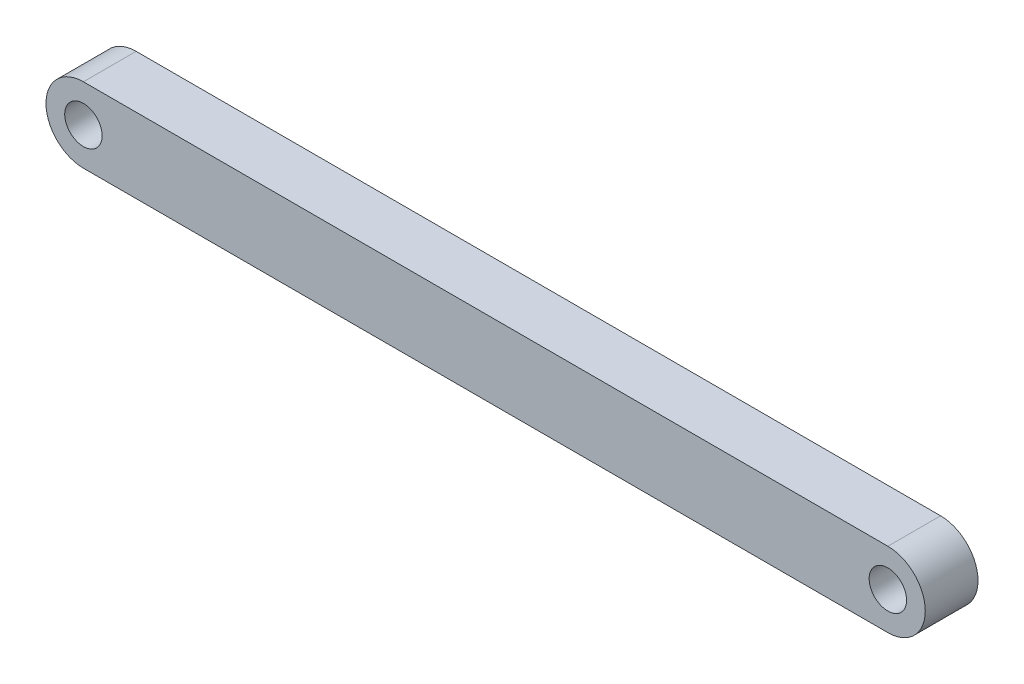
ISO-10303-21;
HEADER;
FILE_DESCRIPTION(('STEP AP214'),'2;1');
FILE_NAME('part.step','',(''),(''),'','','');
FILE_SCHEMA(('AUTOMOTIVE_DESIGN { 1 0 10303 214 1 1 1 1 }'));
ENDSEC;
DATA;
#1=APPLICATION_CONTEXT('core data for automotive mechanical design processes');
#2=APPLICATION_PROTOCOL_DEFINITION('international standard','automotive_design',2000,#1);
#3=PRODUCT_CONTEXT('',#1,'mechanical');
#4=PRODUCT('Part','Part','',(#3));
#5=PRODUCT_RELATED_PRODUCT_CATEGORY('part','',(#4));
#6=PRODUCT_DEFINITION_FORMATION('','',#4);
#7=PRODUCT_DEFINITION_CONTEXT('part definition',#1,'design');
#8=PRODUCT_DEFINITION('design','',#6,#7);
#9=PRODUCT_DEFINITION_SHAPE('','',#8);
#10=(LENGTH_UNIT() NAMED_UNIT(*) SI_UNIT(.MILLI.,.METRE.));
#11=(NAMED_UNIT(*) PLANE_ANGLE_UNIT() SI_UNIT($,.RADIAN.));
#12=(NAMED_UNIT(*) SI_UNIT($,.STERADIAN.) SOLID_ANGLE_UNIT());
#13=UNCERTAINTY_MEASURE_WITH_UNIT(LENGTH_MEASURE(1.E-05),#10,'distance_accuracy_value','');
#14=(GEOMETRIC_REPRESENTATION_CONTEXT(3) GLOBAL_UNCERTAINTY_ASSIGNED_CONTEXT((#13)) GLOBAL_UNIT_ASSIGNED_CONTEXT((#10,
#11,#12)) REPRESENTATION_CONTEXT('',''));
#15=CARTESIAN_POINT('',(0.,0.,0.));
#16=DIRECTION('',(0.,0.,1.));
#17=DIRECTION('',(1.,0.,0.));
#18=AXIS2_PLACEMENT_3D('',#15,#16,#17);
#19=CARTESIAN_POINT('',(-38.15,-2.66400026153731E-13,2.5));
#20=DIRECTION('',(0.,0.,1.));
#21=DIRECTION('',(1.,0.,0.));
#22=AXIS2_PLACEMENT_3D('',#19,#20,#21);
#23=PLANE('',#22);
#24=CARTESIAN_POINT('',(0.,0.,2.5));
#25=DIRECTION('',(0.,0.,1.));
#26=DIRECTION('',(1.,0.,0.));
#27=AXIS2_PLACEMENT_3D('',#24,#25,#26);
#28=CIRCLE('',#27,0.8875);
#29=CARTESIAN_POINT('',(0.8875,0.,2.5));
#30=VERTEX_POINT('',#29);
#31=EDGE_CURVE('E106',#30,#30,#28,.T.);
#32=ORIENTED_EDGE('',*,*,#31,.F.);
#33=EDGE_LOOP('',(#32));
#34=FACE_BOUND('',#33,.T.);
#35=CARTESIAN_POINT('',(-38.15,-2.66400026153731E-13,2.5));
#36=DIRECTION('',(0.,0.,1.));
#37=DIRECTION('',(1.,0.,0.));
#38=AXIS2_PLACEMENT_3D('',#35,#36,#37);
#39=CIRCLE('',#38,1.77499999999973);
#40=CARTESIAN_POINT('',(-38.15,1.77499999999973,2.5));
#41=VERTEX_POINT('',#40);
#42=CARTESIAN_POINT('',(-38.15,-1.77499999999973,2.5));
#43=VERTEX_POINT('',#42);
#44=EDGE_CURVE('E91',#41,#43,#39,.T.);
#45=ORIENTED_EDGE('',*,*,#44,.T.);
#46=DIRECTION('',(1.,0.,0.));
#47=VECTOR('',#46,1.);
#48=CARTESIAN_POINT('',(-38.15,-1.77499999999973,2.5));
#49=LINE('',#48,#47);
#50=CARTESIAN_POINT('',(0.,-1.77499999999968,2.5));
#51=VERTEX_POINT('',#50);
#52=EDGE_CURVE('E86',#43,#51,#49,.T.);
#53=ORIENTED_EDGE('',*,*,#52,.T.);
#54=CARTESIAN_POINT('',(0.,0.,2.5));
#55=DIRECTION('',(0.,0.,1.));
#56=DIRECTION('',(1.,0.,0.));
#57=AXIS2_PLACEMENT_3D('',#54,#55,#56);
#58=CIRCLE('',#57,1.77499999999968);
#59=CARTESIAN_POINT('',(0.,1.77499999999993,2.5));
#60=VERTEX_POINT('',#59);
#61=EDGE_CURVE('E89',#51,#60,#58,.T.);
#62=ORIENTED_EDGE('',*,*,#61,.T.);
#63=DIRECTION('',(-1.,0.,0.));
#64=VECTOR('',#63,1.);
#65=CARTESIAN_POINT('',(-38.15,1.77499999999973,2.5));
#66=LINE('',#65,#64);
#67=EDGE_CURVE('E56',#60,#41,#66,.T.);
#68=ORIENTED_EDGE('',*,*,#67,.T.);
#69=EDGE_LOOP('',(#45,#53,#62,#68));
#70=FACE_BOUND('',#69,.T.);
#71=CARTESIAN_POINT('',(-38.15,-2.66400026153731E-13,2.5));
#72=DIRECTION('',(0.,0.,1.));
#73=DIRECTION('',(1.,0.,0.));
#74=AXIS2_PLACEMENT_3D('',#71,#72,#73);
#75=CIRCLE('',#74,0.887499999999998);
#76=CARTESIAN_POINT('',(-37.2625,-2.66400026153731E-13,2.5));
#77=VERTEX_POINT('',#76);
#78=EDGE_CURVE('E121',#77,#77,#75,.T.);
#79=ORIENTED_EDGE('',*,*,#78,.F.);
#80=EDGE_LOOP('',(#79));
#81=FACE_BOUND('',#80,.T.);
#82=ADVANCED_FACE('F39',(#34,#70,#81),#23,.T.);
#83=CARTESIAN_POINT('',(-38.15,-2.66400026153731E-13,0.));
#84=DIRECTION('',(0.,0.,1.));
#85=DIRECTION('',(1.,0.,0.));
#86=AXIS2_PLACEMENT_3D('',#83,#84,#85);
#87=PLANE('',#86);
#88=CARTESIAN_POINT('',(-38.15,-2.66400026153731E-13,0.));
#89=DIRECTION('',(0.,0.,1.));
#90=DIRECTION('',(1.,0.,0.));
#91=AXIS2_PLACEMENT_3D('',#88,#89,#90);
#92=CIRCLE('',#91,1.77499999999973);
#93=CARTESIAN_POINT('',(-38.15,1.77499999999973,0.));
#94=VERTEX_POINT('',#93);
#95=CARTESIAN_POINT('',(-38.15,-1.77499999999973,0.));
#96=VERTEX_POINT('',#95);
#97=EDGE_CURVE('E103',#94,#96,#92,.T.);
#98=ORIENTED_EDGE('',*,*,#97,.F.);
#99=DIRECTION('',(-1.,0.,0.));
#100=VECTOR('',#99,1.);
#101=CARTESIAN_POINT('',(-38.15,1.77499999999973,0.));
#102=LINE('',#101,#100);
#103=CARTESIAN_POINT('',(0.,1.77499999999993,0.));
#104=VERTEX_POINT('',#103);
#105=EDGE_CURVE('E79',#104,#94,#102,.T.);
#106=ORIENTED_EDGE('',*,*,#105,.F.);
#107=CARTESIAN_POINT('',(0.,0.,0.));
#108=DIRECTION('',(0.,0.,1.));
#109=DIRECTION('',(1.,0.,0.));
#110=AXIS2_PLACEMENT_3D('',#107,#108,#109);
#111=CIRCLE('',#110,1.77499999999968);
#112=CARTESIAN_POINT('',(0.,-1.77499999999968,0.));
#113=VERTEX_POINT('',#112);
#114=EDGE_CURVE('E73',#113,#104,#111,.T.);
#115=ORIENTED_EDGE('',*,*,#114,.F.);
#116=DIRECTION('',(1.,0.,0.));
#117=VECTOR('',#116,1.);
#118=CARTESIAN_POINT('',(-38.15,-1.77499999999973,0.));
#119=LINE('',#118,#117);
#120=EDGE_CURVE('E95',#96,#113,#119,.T.);
#121=ORIENTED_EDGE('',*,*,#120,.F.);
#122=EDGE_LOOP('',(#98,#106,#115,#121));
#123=FACE_BOUND('',#122,.T.);
#124=CARTESIAN_POINT('',(0.,0.,0.));
#125=DIRECTION('',(0.,0.,1.));
#126=DIRECTION('',(1.,0.,0.));
#127=AXIS2_PLACEMENT_3D('',#124,#125,#126);
#128=CIRCLE('',#127,0.8875);
#129=CARTESIAN_POINT('',(0.8875,0.,0.));
#130=VERTEX_POINT('',#129);
#131=EDGE_CURVE('E118',#130,#130,#128,.T.);
#132=ORIENTED_EDGE('',*,*,#131,.T.);
#133=EDGE_LOOP('',(#132));
#134=FACE_BOUND('',#133,.T.);
#135=CARTESIAN_POINT('',(-38.15,-2.66400026153731E-13,0.));
#136=DIRECTION('',(0.,0.,1.));
#137=DIRECTION('',(1.,0.,0.));
#138=AXIS2_PLACEMENT_3D('',#135,#136,#137);
#139=CIRCLE('',#138,0.887499999999998);
#140=CARTESIAN_POINT('',(-37.2625,-2.66400026153731E-13,0.));
#141=VERTEX_POINT('',#140);
#142=EDGE_CURVE('E124',#141,#141,#139,.T.);
#143=ORIENTED_EDGE('',*,*,#142,.T.);
#144=EDGE_LOOP('',(#143));
#145=FACE_BOUND('',#144,.T.);
#146=ADVANCED_FACE('F114',(#123,#134,#145),#87,.F.);
#147=CARTESIAN_POINT('',(-38.15,-2.66400026153731E-13,2.5));
#148=DIRECTION('',(0.,0.,-1.));
#149=DIRECTION('',(-1.,0.,0.));
#150=AXIS2_PLACEMENT_3D('',#147,#148,#149);
#151=CYLINDRICAL_SURFACE('',#150,1.77499999999973);
#152=ORIENTED_EDGE('',*,*,#97,.T.);
#153=DIRECTION('',(0.,0.,-1.));
#154=VECTOR('',#153,1.);
#155=CARTESIAN_POINT('',(-38.15,-1.77499999999973,2.5));
#156=LINE('',#155,#154);
#157=EDGE_CURVE('E11',#43,#96,#156,.T.);
#158=ORIENTED_EDGE('',*,*,#157,.F.);
#159=ORIENTED_EDGE('',*,*,#44,.F.);
#160=DIRECTION('',(0.,0.,-1.));
#161=VECTOR('',#160,1.);
#162=CARTESIAN_POINT('',(-38.15,1.77499999999973,2.5));
#163=LINE('',#162,#161);
#164=EDGE_CURVE('E99',#41,#94,#163,.T.);
#165=ORIENTED_EDGE('',*,*,#164,.T.);
#166=EDGE_LOOP('',(#152,#158,#159,#165));
#167=FACE_BOUND('',#166,.T.);
#168=ADVANCED_FACE('F41',(#167),#151,.T.);
#169=CARTESIAN_POINT('',(-38.15,-1.77499999999973,2.5));
#170=DIRECTION('',(0.,1.,0.));
#171=DIRECTION('',(-1.,0.,0.));
#172=AXIS2_PLACEMENT_3D('',#169,#170,#171);
#173=PLANE('',#172);
#174=ORIENTED_EDGE('',*,*,#120,.T.);
#175=DIRECTION('',(0.,0.,-1.));
#176=VECTOR('',#175,1.);
#177=CARTESIAN_POINT('',(0.,-1.77499999999968,2.5));
#178=LINE('',#177,#176);
#179=EDGE_CURVE('E48',#51,#113,#178,.T.);
#180=ORIENTED_EDGE('',*,*,#179,.F.);
#181=ORIENTED_EDGE('',*,*,#52,.F.);
#182=ORIENTED_EDGE('',*,*,#157,.T.);
#183=EDGE_LOOP('',(#174,#180,#181,#182));
#184=FACE_BOUND('',#183,.T.);
#185=ADVANCED_FACE('F94',(#184),#173,.F.);
#186=CARTESIAN_POINT('',(0.,0.,2.5));
#187=DIRECTION('',(0.,0.,-1.));
#188=DIRECTION('',(-1.,0.,0.));
#189=AXIS2_PLACEMENT_3D('',#186,#187,#188);
#190=CYLINDRICAL_SURFACE('',#189,1.77499999999968);
#191=ORIENTED_EDGE('',*,*,#114,.T.);
#192=DIRECTION('',(0.,0.,-1.));
#193=VECTOR('',#192,1.);
#194=CARTESIAN_POINT('',(0.,1.77499999999993,2.5));
#195=LINE('',#194,#193);
#196=EDGE_CURVE('E96',#60,#104,#195,.T.);
#197=ORIENTED_EDGE('',*,*,#196,.F.);
#198=ORIENTED_EDGE('',*,*,#61,.F.);
#199=ORIENTED_EDGE('',*,*,#179,.T.);
#200=EDGE_LOOP('',(#191,#197,#198,#199));
#201=FACE_BOUND('',#200,.T.);
#202=ADVANCED_FACE('F97',(#201),#190,.T.);
#203=CARTESIAN_POINT('',(-38.15,1.77499999999973,2.5));
#204=DIRECTION('',(0.,-1.,0.));
#205=DIRECTION('',(1.,0.,0.));
#206=AXIS2_PLACEMENT_3D('',#203,#204,#205);
#207=PLANE('',#206);
#208=ORIENTED_EDGE('',*,*,#105,.T.);
#209=ORIENTED_EDGE('',*,*,#164,.F.);
#210=ORIENTED_EDGE('',*,*,#67,.F.);
#211=ORIENTED_EDGE('',*,*,#196,.T.);
#212=EDGE_LOOP('',(#208,#209,#210,#211));
#213=FACE_BOUND('',#212,.T.);
#214=ADVANCED_FACE('F111',(#213),#207,.F.);
#215=CARTESIAN_POINT('',(0.,0.,2.5));
#216=DIRECTION('',(0.,0.,-1.));
#217=DIRECTION('',(-1.,0.,0.));
#218=AXIS2_PLACEMENT_3D('',#215,#216,#217);
#219=CYLINDRICAL_SURFACE('',#218,0.8875);
#220=ORIENTED_EDGE('',*,*,#31,.T.);
#221=EDGE_LOOP('',(#220));
#222=FACE_BOUND('',#221,.T.);
#223=ORIENTED_EDGE('',*,*,#131,.F.);
#224=EDGE_LOOP('',(#223));
#225=FACE_BOUND('',#224,.T.);
#226=ADVANCED_FACE('F141',(#222,#225),#219,.F.);
#227=CARTESIAN_POINT('',(-38.15,-2.66400026153731E-13,2.5));
#228=DIRECTION('',(0.,0.,-1.));
#229=DIRECTION('',(-1.,0.,0.));
#230=AXIS2_PLACEMENT_3D('',#227,#228,#229);
#231=CYLINDRICAL_SURFACE('',#230,0.887499999999998);
#232=ORIENTED_EDGE('',*,*,#78,.T.);
#233=EDGE_LOOP('',(#232));
#234=FACE_BOUND('',#233,.T.);
#235=ORIENTED_EDGE('',*,*,#142,.F.);
#236=EDGE_LOOP('',(#235));
#237=FACE_BOUND('',#236,.T.);
#238=ADVANCED_FACE('F130',(#234,#237),#231,.F.);
#239=CLOSED_SHELL('',(#82,#146,#168,#185,#202,#214,#226,#238));
#240=MANIFOLD_SOLID_BREP('B2',#239);
#241=ADVANCED_BREP_SHAPE_REPRESENTATION('',(#18,#240),#14);
#242=SHAPE_DEFINITION_REPRESENTATION(#9,#241);
ENDSEC;
END-ISO-10303-21;
